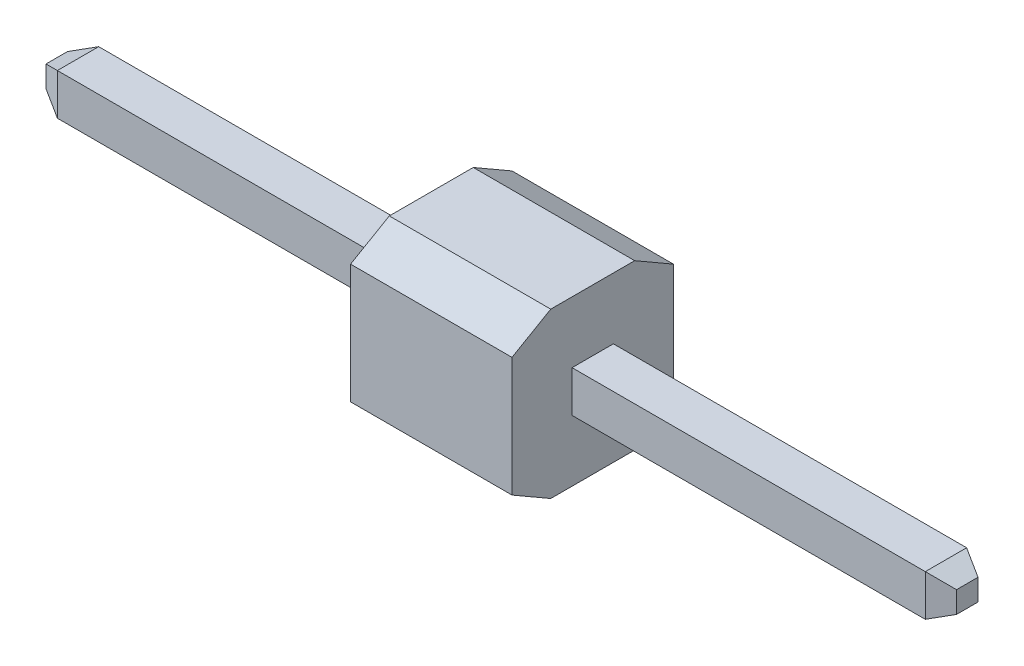
ISO-10303-21;
HEADER;
FILE_DESCRIPTION(('STEP AP214'),'2;1');
FILE_NAME('part.step','',(''),(''),'','','');
FILE_SCHEMA(('AUTOMOTIVE_DESIGN { 1 0 10303 214 1 1 1 1 }'));
ENDSEC;
DATA;
#1=APPLICATION_CONTEXT('core data for automotive mechanical design processes');
#2=APPLICATION_PROTOCOL_DEFINITION('international standard','automotive_design',2000,#1);
#3=PRODUCT_CONTEXT('',#1,'mechanical');
#4=PRODUCT('Part','Part','',(#3));
#5=PRODUCT_RELATED_PRODUCT_CATEGORY('part','',(#4));
#6=PRODUCT_DEFINITION_FORMATION('','',#4);
#7=PRODUCT_DEFINITION_CONTEXT('part definition',#1,'design');
#8=PRODUCT_DEFINITION('design','',#6,#7);
#9=PRODUCT_DEFINITION_SHAPE('','',#8);
#10=(LENGTH_UNIT() NAMED_UNIT(*) SI_UNIT(.MILLI.,.METRE.));
#11=(NAMED_UNIT(*) PLANE_ANGLE_UNIT() SI_UNIT($,.RADIAN.));
#12=(NAMED_UNIT(*) SI_UNIT($,.STERADIAN.) SOLID_ANGLE_UNIT());
#13=UNCERTAINTY_MEASURE_WITH_UNIT(LENGTH_MEASURE(1.E-05),#10,'distance_accuracy_value','');
#14=(GEOMETRIC_REPRESENTATION_CONTEXT(3) GLOBAL_UNCERTAINTY_ASSIGNED_CONTEXT((#13)) GLOBAL_UNIT_ASSIGNED_CONTEXT((#10,
#11,#12)) REPRESENTATION_CONTEXT('',''));
#15=CARTESIAN_POINT('',(0.,0.,0.));
#16=DIRECTION('',(0.,0.,1.));
#17=DIRECTION('',(1.,0.,0.));
#18=AXIS2_PLACEMENT_3D('',#15,#16,#17);
#19=CARTESIAN_POINT('',(5.42105237065274,15.557121448103,-2.62999958673188));
#20=DIRECTION('',(1.,-9.93476518829084E-08,4.37113882867379E-08));
#21=DIRECTION('',(-9.93476589883358E-08,-1.,8.74227765734759E-08));
#22=AXIS2_PLACEMENT_3D('',#19,#20,#21);
#23=PLANE('',#22);
#24=DIRECTION('',(-1.18186632779336E-08,-0.500000075710541,-0.866025360072933));
#25=VECTOR('',#24,1.);
#26=CARTESIAN_POINT('',(5.42105217847814,14.3135317468668,-1.0599994780138));
#27=LINE('',#26,#25);
#28=CARTESIAN_POINT('',(5.42105217847814,14.3135317468668,-1.0599994780138));
#29=VERTEX_POINT('',#28);
#30=CARTESIAN_POINT('',(5.42105217028992,13.9671215329031,-1.65999944772966));
#31=VERTEX_POINT('',#30);
#32=EDGE_CURVE('E11',#29,#31,#27,.T.);
#33=ORIENTED_EDGE('',*,*,#32,.T.);
#34=DIRECTION('',(4.37113811813104E-08,-8.74227842254741E-08,-0.999999999999995));
#35=VECTOR('',#34,1.);
#36=CARTESIAN_POINT('',(5.42105217028992,13.9671215329031,-1.65999944772966));
#37=LINE('',#36,#35);
#38=CARTESIAN_POINT('',(5.42105222711472,13.9671214192535,-2.95999944772966));
#39=VERTEX_POINT('',#38);
#40=EDGE_CURVE('E304',#31,#39,#37,.T.);
#41=ORIENTED_EDGE('',*,*,#40,.T.);
#42=DIRECTION('',(8.75289963531795E-08,0.499999924289839,-0.866025447495711));
#43=VECTOR('',#42,1.);
#44=CARTESIAN_POINT('',(5.42105222711472,13.9671214192535,-2.95999944772966));
#45=LINE('',#44,#43);
#46=CARTESIAN_POINT('',(5.42105228775659,14.3135315283098,-3.5599994780138));
#47=VERTEX_POINT('',#46);
#48=EDGE_CURVE('E296',#39,#47,#45,.T.);
#49=ORIENTED_EDGE('',*,*,#48,.T.);
#50=DIRECTION('',(9.93476588436476E-08,0.999999999999991,-8.74227767226933E-08));
#51=VECTOR('',#50,1.);
#52=CARTESIAN_POINT('',(5.42105228775659,14.3135315283098,-3.5599994780138));
#53=LINE('',#52,#51);
#54=CARTESIAN_POINT('',(5.42105247126956,16.1607112052798,-3.55999963949938));
#55=VERTEX_POINT('',#54);
#56=EDGE_CURVE('E281',#47,#55,#53,.T.);
#57=ORIENTED_EDGE('',*,*,#56,.T.);
#58=DIRECTION('',(-1.18186619958731E-08,-0.500000075710537,-0.866025360072935));
#59=VECTOR('',#58,1.);
#60=CARTESIAN_POINT('',(5.42105247945777,16.5071214192535,-2.95999966978351));
#61=LINE('',#60,#59);
#62=CARTESIAN_POINT('',(5.42105247945777,16.5071214192535,-2.95999966978351));
#63=VERTEX_POINT('',#62);
#64=EDGE_CURVE('E265',#63,#55,#61,.T.);
#65=ORIENTED_EDGE('',*,*,#64,.F.);
#66=DIRECTION('',(4.37113811813104E-08,-8.74227842254741E-08,-0.999999999999995));
#67=VECTOR('',#66,1.);
#68=CARTESIAN_POINT('',(5.42105242263298,16.5071215329031,-1.65999966978351));
#69=LINE('',#68,#67);
#70=CARTESIAN_POINT('',(5.42105242263298,16.5071215329031,-1.65999966978351));
#71=VERTEX_POINT('',#70);
#72=EDGE_CURVE('E248',#71,#63,#69,.T.);
#73=ORIENTED_EDGE('',*,*,#72,.F.);
#74=DIRECTION('',(8.7528996352548E-08,0.499999924289832,-0.866025447495716));
#75=VECTOR('',#74,1.);
#76=CARTESIAN_POINT('',(5.42105236199111,16.1607114238368,-1.05999963949938));
#77=LINE('',#76,#75);
#78=CARTESIAN_POINT('',(5.42105236199111,16.1607114238368,-1.05999963949938));
#79=VERTEX_POINT('',#78);
#80=EDGE_CURVE('E242',#79,#71,#77,.T.);
#81=ORIENTED_EDGE('',*,*,#80,.F.);
#82=DIRECTION('',(9.93476588436476E-08,0.999999999999991,-8.74227762418639E-08));
#83=VECTOR('',#82,1.);
#84=CARTESIAN_POINT('',(5.42105217847814,14.3135317468668,-1.0599994780138));
#85=LINE('',#84,#83);
#86=EDGE_CURVE('E236',#29,#79,#85,.T.);
#87=ORIENTED_EDGE('',*,*,#86,.F.);
#88=EDGE_LOOP('',(#33,#41,#49,#57,#65,#73,#81,#87));
#89=FACE_BOUND('',#88,.T.);
#90=DIRECTION('',(-4.37113817364219E-08,8.74227856773042E-08,0.999999999999995));
#91=VECTOR('',#90,1.);
#92=CARTESIAN_POINT('',(5.42105230707024,14.917121448103,-2.6299995307813));
#93=LINE('',#92,#91);
#94=CARTESIAN_POINT('',(5.42105230707024,14.917121448103,-2.6299995307813));
#95=VERTEX_POINT('',#94);
#96=CARTESIAN_POINT('',(5.42105227909496,14.9171215040536,-1.9899995307813));
#97=VERTEX_POINT('',#96);
#98=EDGE_CURVE('E302',#95,#97,#93,.T.);
#99=ORIENTED_EDGE('',*,*,#98,.T.);
#100=DIRECTION('',(-9.93476592658906E-08,-0.999999999999991,8.74227766567418E-08));
#101=VECTOR('',#100,1.);
#102=CARTESIAN_POINT('',(5.42105234267746,15.5571215040536,-1.98999958673188));
#103=LINE('',#102,#101);
#104=CARTESIAN_POINT('',(5.42105234267746,15.5571215040536,-1.98999958673188));
#105=VERTEX_POINT('',#104);
#106=EDGE_CURVE('E293',#105,#97,#103,.T.);
#107=ORIENTED_EDGE('',*,*,#106,.F.);
#108=DIRECTION('',(-4.37113817364219E-08,8.74227912284194E-08,0.999999999999995));
#109=VECTOR('',#108,1.);
#110=CARTESIAN_POINT('',(5.42105237065274,15.557121448103,-2.62999958673188));
#111=LINE('',#110,#109);
#112=CARTESIAN_POINT('',(5.42105237065274,15.557121448103,-2.62999958673188));
#113=VERTEX_POINT('',#112);
#114=EDGE_CURVE('E278',#113,#105,#111,.T.);
#115=ORIENTED_EDGE('',*,*,#114,.F.);
#116=DIRECTION('',(-9.93476592658906E-08,-0.999999999999991,8.74227759628524E-08));
#117=VECTOR('',#116,1.);
#118=CARTESIAN_POINT('',(5.42105237065274,15.557121448103,-2.62999958673188));
#119=LINE('',#118,#117);
#120=EDGE_CURVE('E263',#113,#95,#119,.T.);
#121=ORIENTED_EDGE('',*,*,#120,.T.);
#122=EDGE_LOOP('',(#99,#107,#115,#121));
#123=FACE_BOUND('',#122,.T.);
#124=ADVANCED_FACE('F17',(#89,#123),#23,.T.);
#125=CARTESIAN_POINT('',(2.92105237065274,15.5571216964722,-2.62999969601035));
#126=DIRECTION('',(1.,-9.93476518829084E-08,4.37113882867379E-08));
#127=DIRECTION('',(-9.93476589883358E-08,-1.,8.74227765734759E-08));
#128=AXIS2_PLACEMENT_3D('',#125,#126,#127);
#129=PLANE('',#128);
#130=DIRECTION('',(-1.18186632779336E-08,-0.500000075710541,-0.866025360072933));
#131=VECTOR('',#130,1.);
#132=CARTESIAN_POINT('',(2.92105217847813,14.3135319952359,-1.05999958729227));
#133=LINE('',#132,#131);
#134=CARTESIAN_POINT('',(2.92105217847813,14.3135319952359,-1.05999958729227));
#135=VERTEX_POINT('',#134);
#136=CARTESIAN_POINT('',(2.92105217028992,13.9671217812723,-1.65999955700813));
#137=VERTEX_POINT('',#136);
#138=EDGE_CURVE('E24',#135,#137,#133,.T.);
#139=ORIENTED_EDGE('',*,*,#138,.F.);
#140=DIRECTION('',(9.93476588436476E-08,0.999999999999991,-8.74227762418639E-08));
#141=VECTOR('',#140,1.);
#142=CARTESIAN_POINT('',(2.92105217847813,14.3135319952359,-1.05999958729227));
#143=LINE('',#142,#141);
#144=CARTESIAN_POINT('',(2.92105236199111,16.1607116722059,-1.05999974877785));
#145=VERTEX_POINT('',#144);
#146=EDGE_CURVE('E300',#135,#145,#143,.T.);
#147=ORIENTED_EDGE('',*,*,#146,.T.);
#148=DIRECTION('',(8.7528996352548E-08,0.499999924289832,-0.866025447495716));
#149=VECTOR('',#148,1.);
#150=CARTESIAN_POINT('',(2.92105236199111,16.1607116722059,-1.05999974877785));
#151=LINE('',#150,#149);
#152=CARTESIAN_POINT('',(2.92105242263298,16.5071217812723,-1.65999977906198));
#153=VERTEX_POINT('',#152);
#154=EDGE_CURVE('E286',#145,#153,#151,.T.);
#155=ORIENTED_EDGE('',*,*,#154,.T.);
#156=DIRECTION('',(4.37113811813104E-08,-8.74227842254741E-08,-0.999999999999995));
#157=VECTOR('',#156,1.);
#158=CARTESIAN_POINT('',(2.92105242263298,16.5071217812723,-1.65999977906198));
#159=LINE('',#158,#157);
#160=CARTESIAN_POINT('',(2.92105247945777,16.5071216676226,-2.95999977906198));
#161=VERTEX_POINT('',#160);
#162=EDGE_CURVE('E271',#153,#161,#159,.T.);
#163=ORIENTED_EDGE('',*,*,#162,.T.);
#164=DIRECTION('',(-1.18186626368607E-08,-0.500000075710537,-0.866025360072935));
#165=VECTOR('',#164,1.);
#166=CARTESIAN_POINT('',(2.92105247945777,16.5071216676226,-2.95999977906198));
#167=LINE('',#166,#165);
#168=CARTESIAN_POINT('',(2.92105247126956,16.160711453649,-3.55999974877785));
#169=VERTEX_POINT('',#168);
#170=EDGE_CURVE('E253',#161,#169,#167,.T.);
#171=ORIENTED_EDGE('',*,*,#170,.T.);
#172=DIRECTION('',(9.93476588436476E-08,0.999999999999991,-8.74227767226933E-08));
#173=VECTOR('',#172,1.);
#174=CARTESIAN_POINT('',(2.92105228775659,14.313531776679,-3.55999958729227));
#175=LINE('',#174,#173);
#176=CARTESIAN_POINT('',(2.92105228775659,14.313531776679,-3.55999958729227));
#177=VERTEX_POINT('',#176);
#178=EDGE_CURVE('E261',#177,#169,#175,.T.);
#179=ORIENTED_EDGE('',*,*,#178,.F.);
#180=DIRECTION('',(8.75289963531795E-08,0.499999924289839,-0.866025447495711));
#181=VECTOR('',#180,1.);
#182=CARTESIAN_POINT('',(2.92105222711472,13.9671216676226,-2.95999955700813));
#183=LINE('',#182,#181);
#184=CARTESIAN_POINT('',(2.92105222711472,13.9671216676226,-2.95999955700813));
#185=VERTEX_POINT('',#184);
#186=EDGE_CURVE('E276',#185,#177,#183,.T.);
#187=ORIENTED_EDGE('',*,*,#186,.F.);
#188=DIRECTION('',(4.37113811813104E-08,-8.74227842254741E-08,-0.999999999999995));
#189=VECTOR('',#188,1.);
#190=CARTESIAN_POINT('',(2.92105217028992,13.9671217812723,-1.65999955700813));
#191=LINE('',#190,#189);
#192=EDGE_CURVE('E291',#137,#185,#191,.T.);
#193=ORIENTED_EDGE('',*,*,#192,.F.);
#194=EDGE_LOOP('',(#139,#147,#155,#163,#171,#179,#187,#193));
#195=FACE_BOUND('',#194,.T.);
#196=DIRECTION('',(-9.93476585720012E-08,-0.999999999999991,8.74227766567418E-08));
#197=VECTOR('',#196,1.);
#198=CARTESIAN_POINT('',(2.92105234267746,15.5571217524228,-1.98999969601035));
#199=LINE('',#198,#197);
#200=CARTESIAN_POINT('',(2.92105234267746,15.5571217524228,-1.98999969601035));
#201=VERTEX_POINT('',#200);
#202=CARTESIAN_POINT('',(2.92105227909496,14.9171217524228,-1.98999964005977));
#203=VERTEX_POINT('',#202);
#204=EDGE_CURVE('E298',#201,#203,#199,.T.);
#205=ORIENTED_EDGE('',*,*,#204,.T.);
#206=DIRECTION('',(-4.37113810425325E-08,8.74227856773042E-08,0.999999999999995));
#207=VECTOR('',#206,1.);
#208=CARTESIAN_POINT('',(2.92105230707024,14.9171216964722,-2.62999964005977));
#209=LINE('',#208,#207);
#210=CARTESIAN_POINT('',(2.92105230707024,14.9171216964722,-2.62999964005977));
#211=VERTEX_POINT('',#210);
#212=EDGE_CURVE('E283',#211,#203,#209,.T.);
#213=ORIENTED_EDGE('',*,*,#212,.F.);
#214=DIRECTION('',(-9.93476592658906E-08,-0.999999999999991,8.74227759628524E-08));
#215=VECTOR('',#214,1.);
#216=CARTESIAN_POINT('',(2.92105237065274,15.5571216964722,-2.62999969601035));
#217=LINE('',#216,#215);
#218=CARTESIAN_POINT('',(2.92105237065274,15.5571216964722,-2.62999969601035));
#219=VERTEX_POINT('',#218);
#220=EDGE_CURVE('E268',#219,#211,#217,.T.);
#221=ORIENTED_EDGE('',*,*,#220,.F.);
#222=DIRECTION('',(-4.37113817364219E-08,8.74227912284194E-08,0.999999999999995));
#223=VECTOR('',#222,1.);
#224=CARTESIAN_POINT('',(2.92105237065274,15.5571216964722,-2.62999969601035));
#225=LINE('',#224,#223);
#226=EDGE_CURVE('E251',#219,#201,#225,.T.);
#227=ORIENTED_EDGE('',*,*,#226,.T.);
#228=EDGE_LOOP('',(#205,#213,#221,#227));
#229=FACE_BOUND('',#228,.T.);
#230=ADVANCED_FACE('F314',(#195,#229),#129,.F.);
#231=CARTESIAN_POINT('',(5.42105217847814,14.3135317468668,-1.0599994780138));
#232=DIRECTION('',(1.07893287081065E-07,0.866025360072937,-0.500000075710535));
#233=DIRECTION('',(1.18186629566715E-08,0.500000075710542,0.866025360072941));
#234=AXIS2_PLACEMENT_3D('',#231,#232,#233);
#235=PLANE('',#234);
#236=ORIENTED_EDGE('',*,*,#138,.T.);
#237=DIRECTION('',(-0.999999999999994,9.93476490407369E-08,-4.37113882867377E-08));
#238=VECTOR('',#237,1.);
#239=CARTESIAN_POINT('',(5.42105217028992,13.9671215329031,-1.65999944772966));
#240=LINE('',#239,#238);
#241=EDGE_CURVE('E288',#31,#137,#240,.T.);
#242=ORIENTED_EDGE('',*,*,#241,.F.);
#243=ORIENTED_EDGE('',*,*,#32,.F.);
#244=DIRECTION('',(-0.999999999999994,9.93476533039933E-08,-4.3711388109102E-08));
#245=VECTOR('',#244,1.);
#246=CARTESIAN_POINT('',(5.42105217847814,14.3135317468668,-1.0599994780138));
#247=LINE('',#246,#245);
#248=EDGE_CURVE('E256',#29,#135,#247,.T.);
#249=ORIENTED_EDGE('',*,*,#248,.T.);
#250=EDGE_LOOP('',(#236,#242,#243,#249));
#251=FACE_BOUND('',#250,.T.);
#252=ADVANCED_FACE('F306',(#251),#235,.F.);
#253=CARTESIAN_POINT('',(5.42105217028992,13.9671215329031,-1.65999944772966));
#254=DIRECTION('',(9.93476589883358E-08,1.,-8.74227765734759E-08));
#255=DIRECTION('',(1.,-9.93476518829084E-08,4.37113882867379E-08));
#256=AXIS2_PLACEMENT_3D('',#253,#254,#255);
#257=PLANE('',#256);
#258=ORIENTED_EDGE('',*,*,#192,.T.);
#259=DIRECTION('',(-0.999999999999994,9.93476490407369E-08,-4.37113882867377E-08));
#260=VECTOR('',#259,1.);
#261=CARTESIAN_POINT('',(5.42105222711472,13.9671214192535,-2.95999944772966));
#262=LINE('',#261,#260);
#263=EDGE_CURVE('E273',#39,#185,#262,.T.);
#264=ORIENTED_EDGE('',*,*,#263,.F.);
#265=ORIENTED_EDGE('',*,*,#40,.F.);
#266=ORIENTED_EDGE('',*,*,#241,.T.);
#267=EDGE_LOOP('',(#258,#264,#265,#266));
#268=FACE_BOUND('',#267,.T.);
#269=ADVANCED_FACE('F311',(#268),#257,.F.);
#270=CARTESIAN_POINT('',(5.42105222711472,13.9671214192535,-2.95999944772966));
#271=DIRECTION('',(6.41819058997377E-08,0.866025447495721,0.499999924289845));
#272=DIRECTION('',(-8.7528996031702E-08,-0.499999924289838,0.866025447495717));
#273=AXIS2_PLACEMENT_3D('',#270,#271,#272);
#274=PLANE('',#273);
#275=ORIENTED_EDGE('',*,*,#186,.T.);
#276=DIRECTION('',(-0.999999999999994,9.93476533039933E-08,-4.37113884643734E-08));
#277=VECTOR('',#276,1.);
#278=CARTESIAN_POINT('',(5.42105228775659,14.3135315283098,-3.5599994780138));
#279=LINE('',#278,#277);
#280=EDGE_CURVE('E258',#47,#177,#279,.T.);
#281=ORIENTED_EDGE('',*,*,#280,.F.);
#282=ORIENTED_EDGE('',*,*,#48,.F.);
#283=ORIENTED_EDGE('',*,*,#263,.T.);
#284=EDGE_LOOP('',(#275,#281,#282,#283));
#285=FACE_BOUND('',#284,.T.);
#286=ADVANCED_FACE('F319',(#285),#274,.F.);
#287=CARTESIAN_POINT('',(5.42105228775659,14.3135315283098,-3.5599994780138));
#288=DIRECTION('',(-4.37113811813106E-08,8.74227836789032E-08,1.));
#289=DIRECTION('',(-1.,9.93476518829084E-08,-4.37113882867379E-08));
#290=AXIS2_PLACEMENT_3D('',#287,#288,#289);
#291=PLANE('',#290);
#292=ORIENTED_EDGE('',*,*,#178,.T.);
#293=DIRECTION('',(-0.999999999999994,9.93476533039933E-08,-4.37113882867377E-08));
#294=VECTOR('',#293,1.);
#295=CARTESIAN_POINT('',(5.42105247126956,16.1607112052798,-3.55999963949938));
#296=LINE('',#295,#294);
#297=EDGE_CURVE('E245',#55,#169,#296,.T.);
#298=ORIENTED_EDGE('',*,*,#297,.F.);
#299=ORIENTED_EDGE('',*,*,#56,.F.);
#300=ORIENTED_EDGE('',*,*,#280,.T.);
#301=EDGE_LOOP('',(#292,#298,#299,#300));
#302=FACE_BOUND('',#301,.T.);
#303=ADVANCED_FACE('F326',(#302),#291,.F.);
#304=CARTESIAN_POINT('',(5.42105247945777,16.5071214192535,-2.95999966978351));
#305=DIRECTION('',(1.07893287081065E-07,0.866025360072937,-0.500000075710535));
#306=DIRECTION('',(1.18186629566715E-08,0.500000075710542,0.866025360072941));
#307=AXIS2_PLACEMENT_3D('',#304,#305,#306);
#308=PLANE('',#307);
#309=ORIENTED_EDGE('',*,*,#170,.F.);
#310=DIRECTION('',(-0.999999999999994,9.93476490407369E-08,-4.37113882867377E-08));
#311=VECTOR('',#310,1.);
#312=CARTESIAN_POINT('',(5.42105247945777,16.5071214192535,-2.95999966978351));
#313=LINE('',#312,#311);
#314=EDGE_CURVE('E239',#63,#161,#313,.T.);
#315=ORIENTED_EDGE('',*,*,#314,.F.);
#316=ORIENTED_EDGE('',*,*,#64,.T.);
#317=ORIENTED_EDGE('',*,*,#297,.T.);
#318=EDGE_LOOP('',(#309,#315,#316,#317));
#319=FACE_BOUND('',#318,.T.);
#320=ADVANCED_FACE('F329',(#319),#308,.T.);
#321=CARTESIAN_POINT('',(5.42105242263298,16.5071215329031,-1.65999966978351));
#322=DIRECTION('',(9.93476589883358E-08,1.,-8.74227765734759E-08));
#323=DIRECTION('',(1.,-9.93476518829084E-08,4.37113882867379E-08));
#324=AXIS2_PLACEMENT_3D('',#321,#322,#323);
#325=PLANE('',#324);
#326=ORIENTED_EDGE('',*,*,#162,.F.);
#327=DIRECTION('',(-0.999999999999994,9.93476490407369E-08,-4.37113883755555E-08));
#328=VECTOR('',#327,1.);
#329=CARTESIAN_POINT('',(5.42105242263298,16.5071215329031,-1.65999966978351));
#330=LINE('',#329,#328);
#331=EDGE_CURVE('E233',#71,#153,#330,.T.);
#332=ORIENTED_EDGE('',*,*,#331,.F.);
#333=ORIENTED_EDGE('',*,*,#72,.T.);
#334=ORIENTED_EDGE('',*,*,#314,.T.);
#335=EDGE_LOOP('',(#326,#332,#333,#334));
#336=FACE_BOUND('',#335,.T.);
#337=ADVANCED_FACE('F333',(#336),#325,.T.);
#338=CARTESIAN_POINT('',(5.42105236199111,16.1607114238368,-1.05999963949938));
#339=DIRECTION('',(6.41819058997377E-08,0.866025447495721,0.499999924289845));
#340=DIRECTION('',(-8.7528996031702E-08,-0.499999924289838,0.866025447495717));
#341=AXIS2_PLACEMENT_3D('',#338,#339,#340);
#342=PLANE('',#341);
#343=ORIENTED_EDGE('',*,*,#154,.F.);
#344=DIRECTION('',(-0.999999999999994,9.93476533039933E-08,-4.3711388109102E-08));
#345=VECTOR('',#344,1.);
#346=CARTESIAN_POINT('',(5.42105236199111,16.1607114238368,-1.05999963949938));
#347=LINE('',#346,#345);
#348=EDGE_CURVE('E230',#79,#145,#347,.T.);
#349=ORIENTED_EDGE('',*,*,#348,.F.);
#350=ORIENTED_EDGE('',*,*,#80,.T.);
#351=ORIENTED_EDGE('',*,*,#331,.T.);
#352=EDGE_LOOP('',(#343,#349,#350,#351));
#353=FACE_BOUND('',#352,.T.);
#354=ADVANCED_FACE('F337',(#353),#342,.T.);
#355=CARTESIAN_POINT('',(5.42105217847814,14.3135317468668,-1.0599994780138));
#356=DIRECTION('',(-4.37113811813106E-08,8.74227835615132E-08,1.));
#357=DIRECTION('',(-9.93476589883358E-08,-1.,8.74227764560859E-08));
#358=AXIS2_PLACEMENT_3D('',#355,#356,#357);
#359=PLANE('',#358);
#360=ORIENTED_EDGE('',*,*,#146,.F.);
#361=ORIENTED_EDGE('',*,*,#248,.F.);
#362=ORIENTED_EDGE('',*,*,#86,.T.);
#363=ORIENTED_EDGE('',*,*,#348,.T.);
#364=EDGE_LOOP('',(#360,#361,#362,#363));
#365=FACE_BOUND('',#364,.T.);
#366=ADVANCED_FACE('F339',(#365),#359,.T.);
#367=CARTESIAN_POINT('',(-2.87894762934726,15.5571222726885,-2.6299999495364));
#368=DIRECTION('',(-1.,9.93476518829084E-08,-4.37113882867379E-08));
#369=DIRECTION('',(9.93476589883358E-08,1.,-8.74227765734759E-08));
#370=AXIS2_PLACEMENT_3D('',#367,#368,#369);
#371=PLANE('',#370);
#372=DIRECTION('',(9.93476554744636E-08,0.999999999999991,-8.7422776141512E-08));
#373=VECTOR('',#372,1.);
#374=CARTESIAN_POINT('',(-2.8789476988909,15.0710038423764,-2.14388143422957));
#375=LINE('',#374,#373);
#376=CARTESIAN_POINT('',(-2.8789476988909,15.0710038423764,-2.14388143422957));
#377=VERTEX_POINT('',#376);
#378=CARTESIAN_POINT('',(-2.87894766588394,15.4032407879864,-2.14388146327465));
#379=VERTEX_POINT('',#378);
#380=EDGE_CURVE('E228',#377,#379,#375,.T.);
#381=ORIENTED_EDGE('',*,*,#380,.T.);
#382=DIRECTION('',(4.37113820547149E-08,-8.74227854960561E-08,-0.999999999999995));
#383=VECTOR('',#382,1.);
#384=CARTESIAN_POINT('',(-2.87894766588394,15.4032407879864,-2.14388146327465));
#385=LINE('',#384,#383);
#386=CARTESIAN_POINT('',(-2.8789476513614,15.4032407589413,-2.47611840889265));
#387=VERTEX_POINT('',#386);
#388=EDGE_CURVE('E223',#379,#387,#385,.T.);
#389=ORIENTED_EDGE('',*,*,#388,.T.);
#390=DIRECTION('',(-9.93476581477919E-08,-0.999999999999991,8.7422776141512E-08));
#391=VECTOR('',#390,1.);
#392=CARTESIAN_POINT('',(-2.8789476513614,15.4032407589413,-2.47611840889265));
#393=LINE('',#392,#391);
#394=CARTESIAN_POINT('',(-2.87894768436836,15.0710038133313,-2.47611837984757));
#395=VERTEX_POINT('',#394);
#396=EDGE_CURVE('E215',#387,#395,#393,.T.);
#397=ORIENTED_EDGE('',*,*,#396,.T.);
#398=DIRECTION('',(-4.37113740347301E-08,8.74227641094299E-08,0.999999999999995));
#399=VECTOR('',#398,1.);
#400=CARTESIAN_POINT('',(-2.87894768436836,15.0710038133313,-2.47611837984757));
#401=LINE('',#400,#399);
#402=EDGE_CURVE('E207',#395,#377,#401,.T.);
#403=ORIENTED_EDGE('',*,*,#402,.T.);
#404=EDGE_LOOP('',(#381,#389,#397,#403));
#405=FACE_BOUND('',#404,.T.);
#406=ADVANCED_FACE('F341',(#405),#371,.T.);
#407=CARTESIAN_POINT('',(-2.87894762934726,15.5571222726885,-2.6299999495364));
#408=DIRECTION('',(9.93476589883358E-08,1.,-8.74227764510112E-08));
#409=DIRECTION('',(-4.37113811813106E-08,8.74227835564385E-08,1.));
#410=AXIS2_PLACEMENT_3D('',#407,#408,#409);
#411=PLANE('',#410);
#412=DIRECTION('',(0.999999999999994,-9.93476527532252E-08,4.37113883581816E-08));
#413=VECTOR('',#412,1.);
#414=CARTESIAN_POINT('',(-2.54894762934726,15.5571222399038,-2.62999993511164));
#415=LINE('',#414,#413);
#416=CARTESIAN_POINT('',(-2.54894762934726,15.5571222399038,-2.62999993511164));
#417=VERTEX_POINT('',#416);
#418=EDGE_CURVE('E225',#417,#219,#415,.T.);
#419=ORIENTED_EDGE('',*,*,#418,.F.);
#420=DIRECTION('',(-4.37113817364219E-08,8.74227912284193E-08,0.999999999999995));
#421=VECTOR('',#420,1.);
#422=CARTESIAN_POINT('',(-2.54894762934726,15.5571222399038,-2.62999993511164));
#423=LINE('',#422,#421);
#424=CARTESIAN_POINT('',(-2.54894765732254,15.5571222958544,-1.98999993511164));
#425=VERTEX_POINT('',#424);
#426=EDGE_CURVE('E217',#417,#425,#423,.T.);
#427=ORIENTED_EDGE('',*,*,#426,.T.);
#428=DIRECTION('',(0.999999999999994,-9.93476527532252E-08,4.37113882364022E-08));
#429=VECTOR('',#428,1.);
#430=CARTESIAN_POINT('',(-2.54894765732254,15.5571222958544,-1.98999993511164));
#431=LINE('',#430,#429);
#432=EDGE_CURVE('E220',#425,#201,#431,.T.);
#433=ORIENTED_EDGE('',*,*,#432,.T.);
#434=ORIENTED_EDGE('',*,*,#226,.F.);
#435=EDGE_LOOP('',(#419,#427,#433,#434));
#436=FACE_BOUND('',#435,.T.);
#437=ADVANCED_FACE('F348',(#436),#411,.T.);
#438=CARTESIAN_POINT('',(-2.87894765732254,15.5571223286391,-1.9899999495364));
#439=DIRECTION('',(-4.37113811813106E-08,8.74227836789032E-08,1.));
#440=DIRECTION('',(-1.,9.93476518829084E-08,-4.37113882867379E-08));
#441=AXIS2_PLACEMENT_3D('',#438,#439,#440);
#442=PLANE('',#441);
#443=ORIENTED_EDGE('',*,*,#432,.F.);
#444=DIRECTION('',(-9.93476592658906E-08,-0.999999999999991,8.74227766567418E-08));
#445=VECTOR('',#444,1.);
#446=CARTESIAN_POINT('',(-2.54894765732254,15.5571222958544,-1.98999993511164));
#447=LINE('',#446,#445);
#448=CARTESIAN_POINT('',(-2.54894772090504,14.9171222958544,-1.98999987916106));
#449=VERTEX_POINT('',#448);
#450=EDGE_CURVE('E209',#425,#449,#447,.T.);
#451=ORIENTED_EDGE('',*,*,#450,.T.);
#452=DIRECTION('',(0.999999999999994,-9.93476495057721E-08,4.37113882364021E-08));
#453=VECTOR('',#452,1.);
#454=CARTESIAN_POINT('',(-2.54894772090504,14.9171222958544,-1.98999987916106));
#455=LINE('',#454,#453);
#456=EDGE_CURVE('E212',#449,#203,#455,.T.);
#457=ORIENTED_EDGE('',*,*,#456,.T.);
#458=ORIENTED_EDGE('',*,*,#204,.F.);
#459=EDGE_LOOP('',(#443,#451,#457,#458));
#460=FACE_BOUND('',#459,.T.);
#461=ADVANCED_FACE('F424',(#460),#442,.T.);
#462=CARTESIAN_POINT('',(-2.87894769292976,14.9171222726885,-2.62999989358582));
#463=DIRECTION('',(9.93476589883357E-08,1.,-8.74227764040693E-08));
#464=DIRECTION('',(-4.37113811813106E-08,8.74227835094966E-08,1.));
#465=AXIS2_PLACEMENT_3D('',#462,#463,#464);
#466=PLANE('',#465);
#467=ORIENTED_EDGE('',*,*,#456,.F.);
#468=DIRECTION('',(4.37113831242006E-08,-8.74227912284193E-08,-0.999999999999995));
#469=VECTOR('',#468,1.);
#470=CARTESIAN_POINT('',(-2.54894772090504,14.9171222958544,-1.98999987916106));
#471=LINE('',#470,#469);
#472=CARTESIAN_POINT('',(-2.54894769292976,14.9171222399038,-2.62999987916106));
#473=VERTEX_POINT('',#472);
#474=EDGE_CURVE('E201',#449,#473,#471,.T.);
#475=ORIENTED_EDGE('',*,*,#474,.T.);
#476=DIRECTION('',(0.999999999999994,-9.93476495057722E-08,4.37113882769953E-08));
#477=VECTOR('',#476,1.);
#478=CARTESIAN_POINT('',(-2.54894769292976,14.9171222399038,-2.62999987916106));
#479=LINE('',#478,#477);
#480=EDGE_CURVE('E204',#473,#211,#479,.T.);
#481=ORIENTED_EDGE('',*,*,#480,.T.);
#482=ORIENTED_EDGE('',*,*,#212,.T.);
#483=EDGE_LOOP('',(#467,#475,#481,#482));
#484=FACE_BOUND('',#483,.T.);
#485=ADVANCED_FACE('F421',(#484),#466,.F.);
#486=CARTESIAN_POINT('',(-2.87894762934726,15.5571222726885,-2.6299999495364));
#487=DIRECTION('',(-4.37113811813106E-08,8.74227836789032E-08,1.));
#488=DIRECTION('',(-1.,9.93476518829084E-08,-4.37113882867379E-08));
#489=AXIS2_PLACEMENT_3D('',#486,#487,#488);
#490=PLANE('',#489);
#491=ORIENTED_EDGE('',*,*,#480,.F.);
#492=DIRECTION('',(9.93476578781118E-08,0.999999999999991,-8.74227766567418E-08));
#493=VECTOR('',#492,1.);
#494=CARTESIAN_POINT('',(-2.54894769292976,14.9171222399038,-2.62999987916106));
#495=LINE('',#494,#493);
#496=EDGE_CURVE('E196',#473,#417,#495,.T.);
#497=ORIENTED_EDGE('',*,*,#496,.T.);
#498=ORIENTED_EDGE('',*,*,#418,.T.);
#499=ORIENTED_EDGE('',*,*,#220,.T.);
#500=EDGE_LOOP('',(#491,#497,#498,#499));
#501=FACE_BOUND('',#500,.T.);
#502=ADVANCED_FACE('F376',(#501),#490,.F.);
#503=CARTESIAN_POINT('',(-2.87894762934726,15.5571222726885,-2.6299999495364));
#504=DIRECTION('',(-4.37113811813106E-08,8.74227836789032E-08,1.));
#505=DIRECTION('',(-1.,9.93476518829084E-08,-4.37113882867379E-08));
#506=AXIS2_PLACEMENT_3D('',#503,#504,#505);
#507=PLANE('',#506);
#508=DIRECTION('',(0.999999999999994,-9.93476469078097E-08,4.37113882769953E-08));
#509=VECTOR('',#508,1.);
#510=CARTESIAN_POINT('',(5.42105237065274,15.5571214481031,-2.62999958673188));
#511=LINE('',#510,#509);
#512=CARTESIAN_POINT('',(10.8910523706527,15.5571209046714,-2.62999934763058));
#513=VERTEX_POINT('',#512);
#514=EDGE_CURVE('E199',#113,#513,#511,.T.);
#515=ORIENTED_EDGE('',*,*,#514,.T.);
#516=DIRECTION('',(-9.93476606536693E-08,-0.999999999999991,8.74227766567418E-08));
#517=VECTOR('',#516,1.);
#518=CARTESIAN_POINT('',(10.8910523706527,15.5571209046714,-2.62999934763058));
#519=LINE('',#518,#517);
#520=CARTESIAN_POINT('',(10.8910523070702,14.9171209046714,-2.62999929168));
#521=VERTEX_POINT('',#520);
#522=EDGE_CURVE('E191',#513,#521,#519,.T.);
#523=ORIENTED_EDGE('',*,*,#522,.T.);
#524=DIRECTION('',(0.999999999999994,-9.93476521037346E-08,4.37113883581817E-08));
#525=VECTOR('',#524,1.);
#526=CARTESIAN_POINT('',(5.42105230707024,14.917121448103,-2.6299995307813));
#527=LINE('',#526,#525);
#528=EDGE_CURVE('E194',#95,#521,#527,.T.);
#529=ORIENTED_EDGE('',*,*,#528,.F.);
#530=ORIENTED_EDGE('',*,*,#120,.F.);
#531=EDGE_LOOP('',(#515,#523,#529,#530));
#532=FACE_BOUND('',#531,.T.);
#533=ADVANCED_FACE('F367',(#532),#507,.F.);
#534=CARTESIAN_POINT('',(-2.87894769292976,14.9171222726885,-2.62999989358582));
#535=DIRECTION('',(9.93476589883357E-08,1.,-8.74227764040693E-08));
#536=DIRECTION('',(-4.37113811813106E-08,8.74227835094966E-08,1.));
#537=AXIS2_PLACEMENT_3D('',#534,#535,#536);
#538=PLANE('',#537);
#539=ORIENTED_EDGE('',*,*,#528,.T.);
#540=DIRECTION('',(-4.37113817364219E-08,8.74227856773043E-08,0.999999999999995));
#541=VECTOR('',#540,1.);
#542=CARTESIAN_POINT('',(10.8910523070702,14.9171209046714,-2.62999929168));
#543=LINE('',#542,#541);
#544=CARTESIAN_POINT('',(10.891052279095,14.917120960622,-1.98999929168));
#545=VERTEX_POINT('',#544);
#546=EDGE_CURVE('E186',#521,#545,#543,.T.);
#547=ORIENTED_EDGE('',*,*,#546,.T.);
#548=DIRECTION('',(0.999999999999994,-9.93476521037346E-08,4.37113881146227E-08));
#549=VECTOR('',#548,1.);
#550=CARTESIAN_POINT('',(5.42105227909496,14.9171215040536,-1.9899995307813));
#551=LINE('',#550,#549);
#552=EDGE_CURVE('E189',#97,#545,#551,.T.);
#553=ORIENTED_EDGE('',*,*,#552,.F.);
#554=ORIENTED_EDGE('',*,*,#98,.F.);
#555=EDGE_LOOP('',(#539,#547,#553,#554));
#556=FACE_BOUND('',#555,.T.);
#557=ADVANCED_FACE('F364',(#556),#538,.F.);
#558=CARTESIAN_POINT('',(-2.87894765732254,15.5571223286391,-1.9899999495364));
#559=DIRECTION('',(-4.37113811813106E-08,8.74227836789032E-08,1.));
#560=DIRECTION('',(-1.,9.93476518829084E-08,-4.37113882867379E-08));
#561=AXIS2_PLACEMENT_3D('',#558,#559,#560);
#562=PLANE('',#561);
#563=ORIENTED_EDGE('',*,*,#552,.T.);
#564=DIRECTION('',(9.93476578781118E-08,0.999999999999991,-8.74227766567418E-08));
#565=VECTOR('',#564,1.);
#566=CARTESIAN_POINT('',(10.891052279095,14.917120960622,-1.98999929168));
#567=LINE('',#566,#565);
#568=CARTESIAN_POINT('',(10.8910523426775,15.557120960622,-1.98999934763058));
#569=VERTEX_POINT('',#568);
#570=EDGE_CURVE('E176',#545,#569,#567,.T.);
#571=ORIENTED_EDGE('',*,*,#570,.T.);
#572=DIRECTION('',(0.999999999999994,-9.93476469078097E-08,4.37113881146227E-08));
#573=VECTOR('',#572,1.);
#574=CARTESIAN_POINT('',(5.42105234267746,15.5571215040536,-1.98999958673188));
#575=LINE('',#574,#573);
#576=EDGE_CURVE('E179',#105,#569,#575,.T.);
#577=ORIENTED_EDGE('',*,*,#576,.F.);
#578=ORIENTED_EDGE('',*,*,#106,.T.);
#579=EDGE_LOOP('',(#563,#571,#577,#578));
#580=FACE_BOUND('',#579,.T.);
#581=ADVANCED_FACE('F366',(#580),#562,.T.);
#582=CARTESIAN_POINT('',(-2.87894762934726,15.5571222726885,-2.6299999495364));
#583=DIRECTION('',(9.93476589883358E-08,1.,-8.74227764510112E-08));
#584=DIRECTION('',(-4.37113811813106E-08,8.74227835564385E-08,1.));
#585=AXIS2_PLACEMENT_3D('',#582,#583,#584);
#586=PLANE('',#585);
#587=ORIENTED_EDGE('',*,*,#576,.T.);
#588=DIRECTION('',(4.37113817364219E-08,-8.74227856773043E-08,-0.999999999999995));
#589=VECTOR('',#588,1.);
#590=CARTESIAN_POINT('',(10.8910523426775,15.557120960622,-1.98999934763058));
#591=LINE('',#590,#589);
#592=EDGE_CURVE('E167',#569,#513,#591,.T.);
#593=ORIENTED_EDGE('',*,*,#592,.T.);
#594=ORIENTED_EDGE('',*,*,#514,.F.);
#595=ORIENTED_EDGE('',*,*,#114,.T.);
#596=EDGE_LOOP('',(#587,#593,#594,#595));
#597=FACE_BOUND('',#596,.T.);
#598=ADVANCED_FACE('F373',(#597),#586,.T.);
#599=CARTESIAN_POINT('',(11.2210523706527,15.5571208718867,-2.62999933320582));
#600=DIRECTION('',(-1.,9.93476518829084E-08,-4.37113882867379E-08));
#601=DIRECTION('',(9.93476589883358E-08,1.,-8.74227765734759E-08));
#602=AXIS2_PLACEMENT_3D('',#599,#600,#601);
#603=PLANE('',#602);
#604=DIRECTION('',(-9.93476581477919E-08,-0.999999999999991,8.74227774781761E-08));
#605=VECTOR('',#604,1.);
#606=CARTESIAN_POINT('',(11.2210523341161,15.4032393871845,-2.14388084694407));
#607=LINE('',#606,#605);
#608=CARTESIAN_POINT('',(11.2210523341161,15.4032393871845,-2.14388084694407));
#609=VERTEX_POINT('',#608);
#610=CARTESIAN_POINT('',(11.2210523011091,15.0710024415745,-2.143880817899));
#611=VERTEX_POINT('',#610);
#612=EDGE_CURVE('E153',#609,#611,#607,.T.);
#613=ORIENTED_EDGE('',*,*,#612,.T.);
#614=DIRECTION('',(4.37113820547149E-08,-8.74227854960561E-08,-0.999999999999995));
#615=VECTOR('',#614,1.);
#616=CARTESIAN_POINT('',(11.2210523011091,15.0710024415745,-2.143880817899));
#617=LINE('',#616,#615);
#618=CARTESIAN_POINT('',(11.2210523156316,15.0710024125294,-2.476117763517));
#619=VERTEX_POINT('',#618);
#620=EDGE_CURVE('E395',#611,#619,#617,.T.);
#621=ORIENTED_EDGE('',*,*,#620,.T.);
#622=DIRECTION('',(9.93476581477919E-08,0.999999999999991,-8.74227774781761E-08));
#623=VECTOR('',#622,1.);
#624=CARTESIAN_POINT('',(11.2210523156316,15.0710024125294,-2.476117763517));
#625=LINE('',#624,#623);
#626=CARTESIAN_POINT('',(11.2210523486386,15.4032393581394,-2.47611779256207));
#627=VERTEX_POINT('',#626);
#628=EDGE_CURVE('E156',#619,#627,#625,.T.);
#629=ORIENTED_EDGE('',*,*,#628,.T.);
#630=DIRECTION('',(-4.37113874013715E-08,8.74227641094299E-08,0.999999999999995));
#631=VECTOR('',#630,1.);
#632=CARTESIAN_POINT('',(11.2210523486386,15.4032393581394,-2.47611779256207));
#633=LINE('',#632,#631);
#634=EDGE_CURVE('E149',#627,#609,#633,.T.);
#635=ORIENTED_EDGE('',*,*,#634,.T.);
#636=EDGE_LOOP('',(#613,#621,#629,#635));
#637=FACE_BOUND('',#636,.T.);
#638=ADVANCED_FACE('F151',(#637),#603,.F.);
#639=CARTESIAN_POINT('',(-2.87894767764199,15.0710037998785,-2.62999990703857));
#640=DIRECTION('',(-0.422618351780369,-0.906307745050466,6.07587120833484E-08));
#641=DIRECTION('',(4.37113811813106E-08,-8.74227835094966E-08,-1.));
#642=AXIS2_PLACEMENT_3D('',#639,#640,#641);
#643=PLANE('',#642);
#644=DIRECTION('',(0.834817073788751,-0.389281669540034,0.3892816911581));
#645=VECTOR('',#644,1.);
#646=CARTESIAN_POINT('',(-2.87894769889092,15.0710038423759,-2.14388143423005));
#647=LINE('',#646,#645);
#648=EDGE_CURVE('E181',#377,#449,#647,.T.);
#649=ORIENTED_EDGE('',*,*,#648,.F.);
#650=ORIENTED_EDGE('',*,*,#402,.F.);
#651=DIRECTION('',(-0.834817107820826,0.389281737604199,0.389281550111905));
#652=VECTOR('',#651,1.);
#653=CARTESIAN_POINT('',(-2.54894769293019,14.9171222399024,-2.62999987916052));
#654=LINE('',#653,#652);
#655=EDGE_CURVE('E404',#473,#395,#654,.T.);
#656=ORIENTED_EDGE('',*,*,#655,.F.);
#657=ORIENTED_EDGE('',*,*,#474,.F.);
#658=EDGE_LOOP('',(#649,#650,#656,#657));
#659=FACE_BOUND('',#658,.T.);
#660=ADVANCED_FACE('F418',(#659),#643,.T.);
#661=CARTESIAN_POINT('',(-2.87894763607363,15.5571222861413,-2.4761184223454));
#662=DIRECTION('',(-0.422618222124847,-3.72458176658199E-08,-0.906307805509828));
#663=DIRECTION('',(9.93476589883358E-08,1.,-8.74227765734759E-08));
#664=AXIS2_PLACEMENT_3D('',#661,#662,#663);
#665=PLANE('',#664);
#666=ORIENTED_EDGE('',*,*,#655,.T.);
#667=ORIENTED_EDGE('',*,*,#396,.F.);
#668=DIRECTION('',(-0.834817185169261,-0.389281503665787,0.389281618176067));
#669=VECTOR('',#668,1.);
#670=CARTESIAN_POINT('',(-2.54894762934611,15.5571222399011,-2.62999993511191));
#671=LINE('',#670,#669);
#672=EDGE_CURVE('E160',#417,#387,#671,.T.);
#673=ORIENTED_EDGE('',*,*,#672,.F.);
#674=ORIENTED_EDGE('',*,*,#496,.F.);
#675=EDGE_LOOP('',(#666,#667,#673,#674));
#676=FACE_BOUND('',#675,.T.);
#677=ADVANCED_FACE('F434',(#676),#665,.T.);
#678=CARTESIAN_POINT('',(-2.54894765732254,15.5571222958544,-1.98999993511164));
#679=DIRECTION('',(0.422618301356777,-1.21218081559392E-07,-0.906307768563367));
#680=DIRECTION('',(-9.93476589883358E-08,-1.,8.74227765734759E-08));
#681=AXIS2_PLACEMENT_3D('',#678,#679,#680);
#682=PLANE('',#681);
#683=ORIENTED_EDGE('',*,*,#648,.T.);
#684=ORIENTED_EDGE('',*,*,#450,.F.);
#685=DIRECTION('',(0.834817151137182,0.389281571729962,0.389281623093937));
#686=VECTOR('',#685,1.);
#687=CARTESIAN_POINT('',(-2.87894766588677,15.4032407879939,-2.14388146327611));
#688=LINE('',#687,#686);
#689=EDGE_CURVE('E170',#379,#425,#688,.T.);
#690=ORIENTED_EDGE('',*,*,#689,.F.);
#691=ORIENTED_EDGE('',*,*,#380,.F.);
#692=EDGE_LOOP('',(#683,#684,#690,#691));
#693=FACE_BOUND('',#692,.T.);
#694=ADVANCED_FACE('F413',(#693),#682,.F.);
#695=CARTESIAN_POINT('',(-2.54894762934726,15.5571222399038,-2.62999993511164));
#696=DIRECTION('',(0.422618171701255,-0.906307829022729,9.770517399793E-08));
#697=DIRECTION('',(-4.37113811813106E-08,8.74227835564385E-08,1.));
#698=AXIS2_PLACEMENT_3D('',#695,#696,#697);
#699=PLANE('',#698);
#700=ORIENTED_EDGE('',*,*,#672,.T.);
#701=ORIENTED_EDGE('',*,*,#388,.F.);
#702=ORIENTED_EDGE('',*,*,#689,.T.);
#703=ORIENTED_EDGE('',*,*,#426,.F.);
#704=EDGE_LOOP('',(#700,#701,#702,#703));
#705=FACE_BOUND('',#704,.T.);
#706=ADVANCED_FACE('F429',(#705),#699,.F.);
#707=CARTESIAN_POINT('',(11.221052355365,15.4032393446867,-2.62999931975307));
#708=DIRECTION('',(0.422618351780369,0.906307745050466,-6.07587121258922E-08));
#709=DIRECTION('',(4.37113811813106E-08,-8.74227835564385E-08,-1.));
#710=AXIS2_PLACEMENT_3D('',#707,#708,#709);
#711=PLANE('',#710);
#712=DIRECTION('',(-0.834817107820822,0.389281737604209,0.389281550111904));
#713=VECTOR('',#712,1.);
#714=CARTESIAN_POINT('',(11.2210523341161,15.403239387185,-2.14388084694456));
#715=LINE('',#714,#713);
#716=EDGE_CURVE('E164',#609,#569,#715,.T.);
#717=ORIENTED_EDGE('',*,*,#716,.F.);
#718=ORIENTED_EDGE('',*,*,#634,.F.);
#719=DIRECTION('',(0.834817073788753,-0.389281669540028,0.389281691158102));
#720=VECTOR('',#719,1.);
#721=CARTESIAN_POINT('',(10.8910523706527,15.5571209046714,-2.62999934763058));
#722=LINE('',#721,#720);
#723=EDGE_CURVE('E392',#513,#627,#722,.T.);
#724=ORIENTED_EDGE('',*,*,#723,.F.);
#725=ORIENTED_EDGE('',*,*,#592,.F.);
#726=EDGE_LOOP('',(#717,#718,#724,#725));
#727=FACE_BOUND('',#726,.T.);
#728=ADVANCED_FACE('F165',(#727),#711,.T.);
#729=CARTESIAN_POINT('',(10.8910523706527,15.5571209046714,-2.62999934763058));
#730=DIRECTION('',(-0.422618301356777,1.21218081559392E-07,0.906307768563367));
#731=DIRECTION('',(-9.93476589883358E-08,-1.,8.74227765734759E-08));
#732=AXIS2_PLACEMENT_3D('',#729,#730,#731);
#733=PLANE('',#732);
#734=ORIENTED_EDGE('',*,*,#723,.T.);
#735=ORIENTED_EDGE('',*,*,#628,.F.);
#736=DIRECTION('',(0.83481715113718,0.389281571729967,0.389281623093936));
#737=VECTOR('',#736,1.);
#738=CARTESIAN_POINT('',(10.8910523070718,14.9171209046672,-2.6299992916791));
#739=LINE('',#738,#737);
#740=EDGE_CURVE('E389',#521,#619,#739,.T.);
#741=ORIENTED_EDGE('',*,*,#740,.F.);
#742=ORIENTED_EDGE('',*,*,#522,.F.);
#743=EDGE_LOOP('',(#734,#735,#741,#742));
#744=FACE_BOUND('',#743,.T.);
#745=ADVANCED_FACE('F390',(#744),#733,.F.);
#746=CARTESIAN_POINT('',(11.2210523494038,15.5571209143845,-2.14388086039682));
#747=DIRECTION('',(0.422618222124847,3.72458176658199E-08,0.906307805509828));
#748=DIRECTION('',(9.93476589883358E-08,1.,-8.74227765734759E-08));
#749=AXIS2_PLACEMENT_3D('',#746,#747,#748);
#750=PLANE('',#749);
#751=ORIENTED_EDGE('',*,*,#716,.T.);
#752=ORIENTED_EDGE('',*,*,#570,.F.);
#753=DIRECTION('',(-0.834817185169256,-0.389281503665799,0.389281618176065));
#754=VECTOR('',#753,1.);
#755=CARTESIAN_POINT('',(11.2210523011091,15.071002441574,-2.14388081789948));
#756=LINE('',#755,#754);
#757=EDGE_CURVE('E175',#611,#545,#756,.T.);
#758=ORIENTED_EDGE('',*,*,#757,.F.);
#759=ORIENTED_EDGE('',*,*,#612,.F.);
#760=EDGE_LOOP('',(#751,#752,#758,#759));
#761=FACE_BOUND('',#760,.T.);
#762=ADVANCED_FACE('F173',(#761),#750,.T.);
#763=CARTESIAN_POINT('',(10.8910523070702,14.9171209046714,-2.62999929168));
#764=DIRECTION('',(-0.422618171701255,0.906307829022729,-9.77051739553862E-08));
#765=DIRECTION('',(-4.37113811813106E-08,8.74227835094966E-08,1.));
#766=AXIS2_PLACEMENT_3D('',#763,#764,#765);
#767=PLANE('',#766);
#768=ORIENTED_EDGE('',*,*,#740,.T.);
#769=ORIENTED_EDGE('',*,*,#620,.F.);
#770=ORIENTED_EDGE('',*,*,#757,.T.);
#771=ORIENTED_EDGE('',*,*,#546,.F.);
#772=EDGE_LOOP('',(#768,#769,#770,#771));
#773=FACE_BOUND('',#772,.T.);
#774=ADVANCED_FACE('F394',(#773),#767,.F.);
#775=CLOSED_SHELL('',(#124,#230,#252,#269,#286,#303,#320,#337,#354,#366,#406,#437,#461,#485,
#502,#533,#557,#581,#598,#638,#660,#677,#694,#706,#728,#745,#762,#774));
#776=MANIFOLD_SOLID_BREP('B1',#775);
#777=ADVANCED_BREP_SHAPE_REPRESENTATION('',(#18,#776),#14);
#778=SHAPE_DEFINITION_REPRESENTATION(#9,#777);
ENDSEC;
END-ISO-10303-21;
